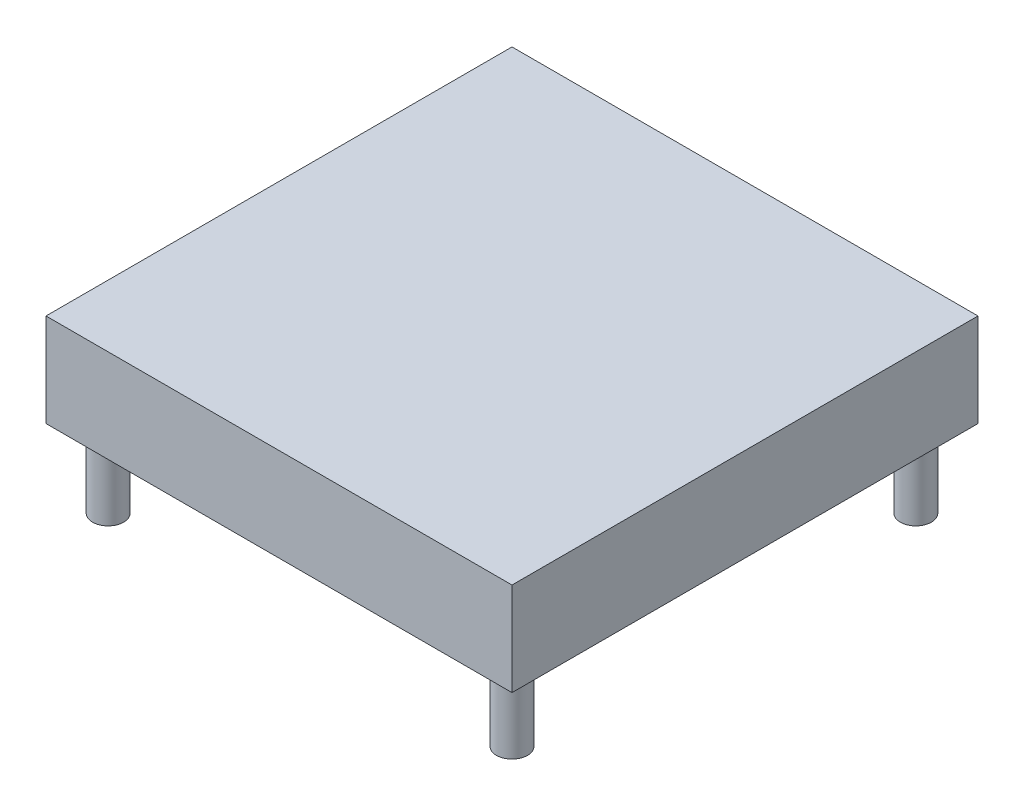
ISO-10303-21;
HEADER;
FILE_DESCRIPTION(('STEP AP214'),'2;1');
FILE_NAME('part.step','',(''),(''),'','','');
FILE_SCHEMA(('AUTOMOTIVE_DESIGN { 1 0 10303 214 1 1 1 1 }'));
ENDSEC;
DATA;
#1=APPLICATION_CONTEXT('core data for automotive mechanical design processes');
#2=APPLICATION_PROTOCOL_DEFINITION('international standard','automotive_design',2000,#1);
#3=PRODUCT_CONTEXT('',#1,'mechanical');
#4=PRODUCT('Part','Part','',(#3));
#5=PRODUCT_RELATED_PRODUCT_CATEGORY('part','',(#4));
#6=PRODUCT_DEFINITION_FORMATION('','',#4);
#7=PRODUCT_DEFINITION_CONTEXT('part definition',#1,'design');
#8=PRODUCT_DEFINITION('design','',#6,#7);
#9=PRODUCT_DEFINITION_SHAPE('','',#8);
#10=(LENGTH_UNIT() NAMED_UNIT(*) SI_UNIT(.MILLI.,.METRE.));
#11=(NAMED_UNIT(*) PLANE_ANGLE_UNIT() SI_UNIT($,.RADIAN.));
#12=(NAMED_UNIT(*) SI_UNIT($,.STERADIAN.) SOLID_ANGLE_UNIT());
#13=UNCERTAINTY_MEASURE_WITH_UNIT(LENGTH_MEASURE(1.E-05),#10,'distance_accuracy_value','');
#14=(GEOMETRIC_REPRESENTATION_CONTEXT(3) GLOBAL_UNCERTAINTY_ASSIGNED_CONTEXT((#13)) GLOBAL_UNIT_ASSIGNED_CONTEXT((#10,
#11,#12)) REPRESENTATION_CONTEXT('',''));
#15=CARTESIAN_POINT('',(0.,0.,0.));
#16=DIRECTION('',(0.,0.,1.));
#17=DIRECTION('',(1.,0.,0.));
#18=AXIS2_PLACEMENT_3D('',#15,#16,#17);
#19=CARTESIAN_POINT('',(19.05,0.,19.05));
#20=DIRECTION('',(0.,1.,0.));
#21=DIRECTION('',(0.,0.,1.));
#22=AXIS2_PLACEMENT_3D('',#19,#20,#21);
#23=PLANE('',#22);
#24=CARTESIAN_POINT('',(-16.51,0.,-16.51));
#25=DIRECTION('',(0.,1.,0.));
#26=DIRECTION('',(0.,0.,1.));
#27=AXIS2_PLACEMENT_3D('',#24,#25,#26);
#28=CIRCLE('',#27,1.27);
#29=CARTESIAN_POINT('',(-16.51,0.,-15.24));
#30=VERTEX_POINT('',#29);
#31=EDGE_CURVE('E39',#30,#30,#28,.F.);
#32=ORIENTED_EDGE('',*,*,#31,.F.);
#33=EDGE_LOOP('',(#32));
#34=FACE_BOUND('',#33,.T.);
#35=CARTESIAN_POINT('',(16.51,0.,16.51));
#36=DIRECTION('',(0.,1.,0.));
#37=DIRECTION('',(0.,0.,1.));
#38=AXIS2_PLACEMENT_3D('',#35,#36,#37);
#39=CIRCLE('',#38,1.27);
#40=CARTESIAN_POINT('',(16.51,0.,17.78));
#41=VERTEX_POINT('',#40);
#42=EDGE_CURVE('E108',#41,#41,#39,.F.);
#43=ORIENTED_EDGE('',*,*,#42,.F.);
#44=EDGE_LOOP('',(#43));
#45=FACE_BOUND('',#44,.T.);
#46=DIRECTION('',(0.,0.,-1.));
#47=VECTOR('',#46,1.);
#48=CARTESIAN_POINT('',(19.05,0.,-19.05));
#49=LINE('',#48,#47);
#50=CARTESIAN_POINT('',(19.05,0.,19.05));
#51=VERTEX_POINT('',#50);
#52=CARTESIAN_POINT('',(19.05,0.,-19.05));
#53=VERTEX_POINT('',#52);
#54=EDGE_CURVE('E98',#51,#53,#49,.T.);
#55=ORIENTED_EDGE('',*,*,#54,.F.);
#56=DIRECTION('',(1.,0.,0.));
#57=VECTOR('',#56,1.);
#58=CARTESIAN_POINT('',(-19.05,0.,19.05));
#59=LINE('',#58,#57);
#60=CARTESIAN_POINT('',(-19.05,0.,19.05));
#61=VERTEX_POINT('',#60);
#62=EDGE_CURVE('E70',#61,#51,#59,.T.);
#63=ORIENTED_EDGE('',*,*,#62,.F.);
#64=DIRECTION('',(0.,0.,1.));
#65=VECTOR('',#64,1.);
#66=CARTESIAN_POINT('',(-19.05,0.,-19.05));
#67=LINE('',#66,#65);
#68=CARTESIAN_POINT('',(-19.05,0.,-19.05));
#69=VERTEX_POINT('',#68);
#70=EDGE_CURVE('E64',#69,#61,#67,.T.);
#71=ORIENTED_EDGE('',*,*,#70,.F.);
#72=DIRECTION('',(-1.,0.,0.));
#73=VECTOR('',#72,1.);
#74=CARTESIAN_POINT('',(-19.05,0.,-19.05));
#75=LINE('',#74,#73);
#76=EDGE_CURVE('E88',#53,#69,#75,.T.);
#77=ORIENTED_EDGE('',*,*,#76,.F.);
#78=EDGE_LOOP('',(#55,#63,#71,#77));
#79=FACE_BOUND('',#78,.T.);
#80=CARTESIAN_POINT('',(16.51,0.,-16.51));
#81=DIRECTION('',(0.,1.,0.));
#82=DIRECTION('',(0.,0.,1.));
#83=AXIS2_PLACEMENT_3D('',#80,#81,#82);
#84=CIRCLE('',#83,1.27);
#85=CARTESIAN_POINT('',(16.51,0.,-15.24));
#86=VERTEX_POINT('',#85);
#87=EDGE_CURVE('E111',#86,#86,#84,.F.);
#88=ORIENTED_EDGE('',*,*,#87,.F.);
#89=EDGE_LOOP('',(#88));
#90=FACE_BOUND('',#89,.T.);
#91=CARTESIAN_POINT('',(-16.51,0.,16.51));
#92=DIRECTION('',(0.,1.,0.));
#93=DIRECTION('',(0.,0.,1.));
#94=AXIS2_PLACEMENT_3D('',#91,#92,#93);
#95=CIRCLE('',#94,1.27);
#96=CARTESIAN_POINT('',(-16.51,0.,17.78));
#97=VERTEX_POINT('',#96);
#98=EDGE_CURVE('E11',#97,#97,#95,.F.);
#99=ORIENTED_EDGE('',*,*,#98,.F.);
#100=EDGE_LOOP('',(#99));
#101=FACE_BOUND('',#100,.T.);
#102=ADVANCED_FACE('F30',(#34,#45,#79,#90,#101),#23,.F.);
#103=CARTESIAN_POINT('',(19.05,7.62,-19.05));
#104=DIRECTION('',(-1.,0.,0.));
#105=DIRECTION('',(0.,0.,1.));
#106=AXIS2_PLACEMENT_3D('',#103,#104,#105);
#107=PLANE('',#106);
#108=ORIENTED_EDGE('',*,*,#54,.T.);
#109=DIRECTION('',(0.,-1.,0.));
#110=VECTOR('',#109,1.);
#111=CARTESIAN_POINT('',(19.05,7.62,-19.05));
#112=LINE('',#111,#110);
#113=CARTESIAN_POINT('',(19.05,7.62,-19.05));
#114=VERTEX_POINT('',#113);
#115=EDGE_CURVE('E89',#114,#53,#112,.T.);
#116=ORIENTED_EDGE('',*,*,#115,.F.);
#117=DIRECTION('',(0.,0.,-1.));
#118=VECTOR('',#117,1.);
#119=CARTESIAN_POINT('',(19.05,7.62,-19.05));
#120=LINE('',#119,#118);
#121=CARTESIAN_POINT('',(19.05,7.62,19.05));
#122=VERTEX_POINT('',#121);
#123=EDGE_CURVE('E83',#122,#114,#120,.T.);
#124=ORIENTED_EDGE('',*,*,#123,.F.);
#125=DIRECTION('',(0.,-1.,0.));
#126=VECTOR('',#125,1.);
#127=CARTESIAN_POINT('',(19.05,7.62,19.05));
#128=LINE('',#127,#126);
#129=EDGE_CURVE('E94',#122,#51,#128,.T.);
#130=ORIENTED_EDGE('',*,*,#129,.T.);
#131=EDGE_LOOP('',(#108,#116,#124,#130));
#132=FACE_BOUND('',#131,.T.);
#133=ADVANCED_FACE('F32',(#132),#107,.F.);
#134=CARTESIAN_POINT('',(-19.05,7.62,-19.05));
#135=DIRECTION('',(0.,0.,1.));
#136=DIRECTION('',(1.,0.,0.));
#137=AXIS2_PLACEMENT_3D('',#134,#135,#136);
#138=PLANE('',#137);
#139=ORIENTED_EDGE('',*,*,#76,.T.);
#140=DIRECTION('',(0.,-1.,0.));
#141=VECTOR('',#140,1.);
#142=CARTESIAN_POINT('',(-19.05,7.62,-19.05));
#143=LINE('',#142,#141);
#144=CARTESIAN_POINT('',(-19.05,7.62,-19.05));
#145=VERTEX_POINT('',#144);
#146=EDGE_CURVE('E86',#145,#69,#143,.T.);
#147=ORIENTED_EDGE('',*,*,#146,.F.);
#148=DIRECTION('',(-1.,0.,0.));
#149=VECTOR('',#148,1.);
#150=CARTESIAN_POINT('',(-19.05,7.62,-19.05));
#151=LINE('',#150,#149);
#152=EDGE_CURVE('E78',#114,#145,#151,.T.);
#153=ORIENTED_EDGE('',*,*,#152,.F.);
#154=ORIENTED_EDGE('',*,*,#115,.T.);
#155=EDGE_LOOP('',(#139,#147,#153,#154));
#156=FACE_BOUND('',#155,.T.);
#157=ADVANCED_FACE('F87',(#156),#138,.F.);
#158=CARTESIAN_POINT('',(-19.05,7.62,-19.05));
#159=DIRECTION('',(1.,0.,0.));
#160=DIRECTION('',(0.,0.,-1.));
#161=AXIS2_PLACEMENT_3D('',#158,#159,#160);
#162=PLANE('',#161);
#163=ORIENTED_EDGE('',*,*,#70,.T.);
#164=DIRECTION('',(0.,-1.,0.));
#165=VECTOR('',#164,1.);
#166=CARTESIAN_POINT('',(-19.05,7.62,19.05));
#167=LINE('',#166,#165);
#168=CARTESIAN_POINT('',(-19.05,7.62,19.05));
#169=VERTEX_POINT('',#168);
#170=EDGE_CURVE('E90',#169,#61,#167,.T.);
#171=ORIENTED_EDGE('',*,*,#170,.F.);
#172=DIRECTION('',(0.,0.,1.));
#173=VECTOR('',#172,1.);
#174=CARTESIAN_POINT('',(-19.05,7.62,-19.05));
#175=LINE('',#174,#173);
#176=EDGE_CURVE('E81',#145,#169,#175,.T.);
#177=ORIENTED_EDGE('',*,*,#176,.F.);
#178=ORIENTED_EDGE('',*,*,#146,.T.);
#179=EDGE_LOOP('',(#163,#171,#177,#178));
#180=FACE_BOUND('',#179,.T.);
#181=ADVANCED_FACE('F92',(#180),#162,.F.);
#182=CARTESIAN_POINT('',(-19.05,7.62,19.05));
#183=DIRECTION('',(0.,0.,-1.));
#184=DIRECTION('',(-1.,0.,0.));
#185=AXIS2_PLACEMENT_3D('',#182,#183,#184);
#186=PLANE('',#185);
#187=ORIENTED_EDGE('',*,*,#62,.T.);
#188=ORIENTED_EDGE('',*,*,#129,.F.);
#189=DIRECTION('',(1.,0.,0.));
#190=VECTOR('',#189,1.);
#191=CARTESIAN_POINT('',(-19.05,7.62,19.05));
#192=LINE('',#191,#190);
#193=EDGE_CURVE('E47',#169,#122,#192,.T.);
#194=ORIENTED_EDGE('',*,*,#193,.F.);
#195=ORIENTED_EDGE('',*,*,#170,.T.);
#196=EDGE_LOOP('',(#187,#188,#194,#195));
#197=FACE_BOUND('',#196,.T.);
#198=ADVANCED_FACE('F165',(#197),#186,.F.);
#199=CARTESIAN_POINT('',(19.05,7.62,19.05));
#200=DIRECTION('',(0.,1.,0.));
#201=DIRECTION('',(0.,0.,1.));
#202=AXIS2_PLACEMENT_3D('',#199,#200,#201);
#203=PLANE('',#202);
#204=ORIENTED_EDGE('',*,*,#123,.T.);
#205=ORIENTED_EDGE('',*,*,#152,.T.);
#206=ORIENTED_EDGE('',*,*,#176,.T.);
#207=ORIENTED_EDGE('',*,*,#193,.T.);
#208=EDGE_LOOP('',(#204,#205,#206,#207));
#209=FACE_BOUND('',#208,.T.);
#210=ADVANCED_FACE('F79',(#209),#203,.T.);
#211=CARTESIAN_POINT('',(16.51,-6.35,16.51));
#212=DIRECTION('',(0.,1.,0.));
#213=DIRECTION('',(0.,0.,1.));
#214=AXIS2_PLACEMENT_3D('',#211,#212,#213);
#215=CYLINDRICAL_SURFACE('',#214,1.27);
#216=CARTESIAN_POINT('',(16.51,-6.35,16.51));
#217=DIRECTION('',(0.,-1.,0.));
#218=DIRECTION('',(0.,0.,-1.));
#219=AXIS2_PLACEMENT_3D('',#216,#217,#218);
#220=CIRCLE('',#219,1.27);
#221=CARTESIAN_POINT('',(16.51,-6.35,15.24));
#222=VERTEX_POINT('',#221);
#223=EDGE_CURVE('E101',#222,#222,#220,.T.);
#224=ORIENTED_EDGE('',*,*,#223,.F.);
#225=EDGE_LOOP('',(#224));
#226=FACE_BOUND('',#225,.T.);
#227=ORIENTED_EDGE('',*,*,#42,.T.);
#228=EDGE_LOOP('',(#227));
#229=FACE_BOUND('',#228,.T.);
#230=ADVANCED_FACE('F159',(#226,#229),#215,.T.);
#231=CARTESIAN_POINT('',(16.51,-6.35,16.51));
#232=DIRECTION('',(0.,-1.,0.));
#233=DIRECTION('',(0.,0.,-1.));
#234=AXIS2_PLACEMENT_3D('',#231,#232,#233);
#235=PLANE('',#234);
#236=ORIENTED_EDGE('',*,*,#223,.T.);
#237=EDGE_LOOP('',(#236));
#238=FACE_BOUND('',#237,.T.);
#239=ADVANCED_FACE('F155',(#238),#235,.T.);
#240=CARTESIAN_POINT('',(16.51,-6.35,-16.51));
#241=DIRECTION('',(0.,1.,0.));
#242=DIRECTION('',(0.,0.,1.));
#243=AXIS2_PLACEMENT_3D('',#240,#241,#242);
#244=CYLINDRICAL_SURFACE('',#243,1.27);
#245=CARTESIAN_POINT('',(16.51,-6.35,-16.51));
#246=DIRECTION('',(0.,-1.,0.));
#247=DIRECTION('',(0.,0.,1.));
#248=AXIS2_PLACEMENT_3D('',#245,#246,#247);
#249=CIRCLE('',#248,1.27);
#250=CARTESIAN_POINT('',(16.51,-6.35,-15.24));
#251=VERTEX_POINT('',#250);
#252=EDGE_CURVE('E180',#251,#251,#249,.T.);
#253=ORIENTED_EDGE('',*,*,#252,.F.);
#254=EDGE_LOOP('',(#253));
#255=FACE_BOUND('',#254,.T.);
#256=ORIENTED_EDGE('',*,*,#87,.T.);
#257=EDGE_LOOP('',(#256));
#258=FACE_BOUND('',#257,.T.);
#259=ADVANCED_FACE('F151',(#255,#258),#244,.T.);
#260=CARTESIAN_POINT('',(16.51,-6.35,-16.51));
#261=DIRECTION('',(0.,1.,0.));
#262=DIRECTION('',(0.,0.,1.));
#263=AXIS2_PLACEMENT_3D('',#260,#261,#262);
#264=PLANE('',#263);
#265=ORIENTED_EDGE('',*,*,#252,.T.);
#266=EDGE_LOOP('',(#265));
#267=FACE_BOUND('',#266,.T.);
#268=ADVANCED_FACE('F147',(#267),#264,.F.);
#269=CARTESIAN_POINT('',(-16.51,-6.35,-16.51));
#270=DIRECTION('',(0.,1.,0.));
#271=DIRECTION('',(0.,0.,1.));
#272=AXIS2_PLACEMENT_3D('',#269,#270,#271);
#273=CYLINDRICAL_SURFACE('',#272,1.27);
#274=CARTESIAN_POINT('',(-16.51,-6.35,-16.51));
#275=DIRECTION('',(0.,-1.,0.));
#276=DIRECTION('',(0.,0.,-1.));
#277=AXIS2_PLACEMENT_3D('',#274,#275,#276);
#278=CIRCLE('',#277,1.27);
#279=CARTESIAN_POINT('',(-16.51,-6.35,-17.78));
#280=VERTEX_POINT('',#279);
#281=EDGE_CURVE('E183',#280,#280,#278,.T.);
#282=ORIENTED_EDGE('',*,*,#281,.F.);
#283=EDGE_LOOP('',(#282));
#284=FACE_BOUND('',#283,.T.);
#285=ORIENTED_EDGE('',*,*,#31,.T.);
#286=EDGE_LOOP('',(#285));
#287=FACE_BOUND('',#286,.T.);
#288=ADVANCED_FACE('F116',(#284,#287),#273,.T.);
#289=CARTESIAN_POINT('',(-16.51,-6.35,-16.51));
#290=DIRECTION('',(0.,-1.,0.));
#291=DIRECTION('',(0.,0.,-1.));
#292=AXIS2_PLACEMENT_3D('',#289,#290,#291);
#293=PLANE('',#292);
#294=ORIENTED_EDGE('',*,*,#281,.T.);
#295=EDGE_LOOP('',(#294));
#296=FACE_BOUND('',#295,.T.);
#297=ADVANCED_FACE('F132',(#296),#293,.T.);
#298=CARTESIAN_POINT('',(-16.51,-6.35,16.51));
#299=DIRECTION('',(0.,1.,0.));
#300=DIRECTION('',(0.,0.,1.));
#301=AXIS2_PLACEMENT_3D('',#298,#299,#300);
#302=CYLINDRICAL_SURFACE('',#301,1.27);
#303=CARTESIAN_POINT('',(-16.51,-6.35,16.51));
#304=DIRECTION('',(0.,-1.,0.));
#305=DIRECTION('',(0.,0.,1.));
#306=AXIS2_PLACEMENT_3D('',#303,#304,#305);
#307=CIRCLE('',#306,1.27);
#308=CARTESIAN_POINT('',(-16.51,-6.35,17.78));
#309=VERTEX_POINT('',#308);
#310=EDGE_CURVE('E186',#309,#309,#307,.T.);
#311=ORIENTED_EDGE('',*,*,#310,.F.);
#312=EDGE_LOOP('',(#311));
#313=FACE_BOUND('',#312,.T.);
#314=ORIENTED_EDGE('',*,*,#98,.T.);
#315=EDGE_LOOP('',(#314));
#316=FACE_BOUND('',#315,.T.);
#317=ADVANCED_FACE('F129',(#313,#316),#302,.T.);
#318=CARTESIAN_POINT('',(-16.51,-6.35,16.51));
#319=DIRECTION('',(0.,1.,0.));
#320=DIRECTION('',(0.,0.,1.));
#321=AXIS2_PLACEMENT_3D('',#318,#319,#320);
#322=PLANE('',#321);
#323=ORIENTED_EDGE('',*,*,#310,.T.);
#324=EDGE_LOOP('',(#323));
#325=FACE_BOUND('',#324,.T.);
#326=ADVANCED_FACE('F131',(#325),#322,.F.);
#327=CLOSED_SHELL('',(#102,#133,#157,#181,#198,#210,#230,#239,#259,#268,#288,#297,#317,#326));
#328=MANIFOLD_SOLID_BREP('B2',#327);
#329=ADVANCED_BREP_SHAPE_REPRESENTATION('',(#18,#328),#14);
#330=SHAPE_DEFINITION_REPRESENTATION(#9,#329);
ENDSEC;
END-ISO-10303-21;
